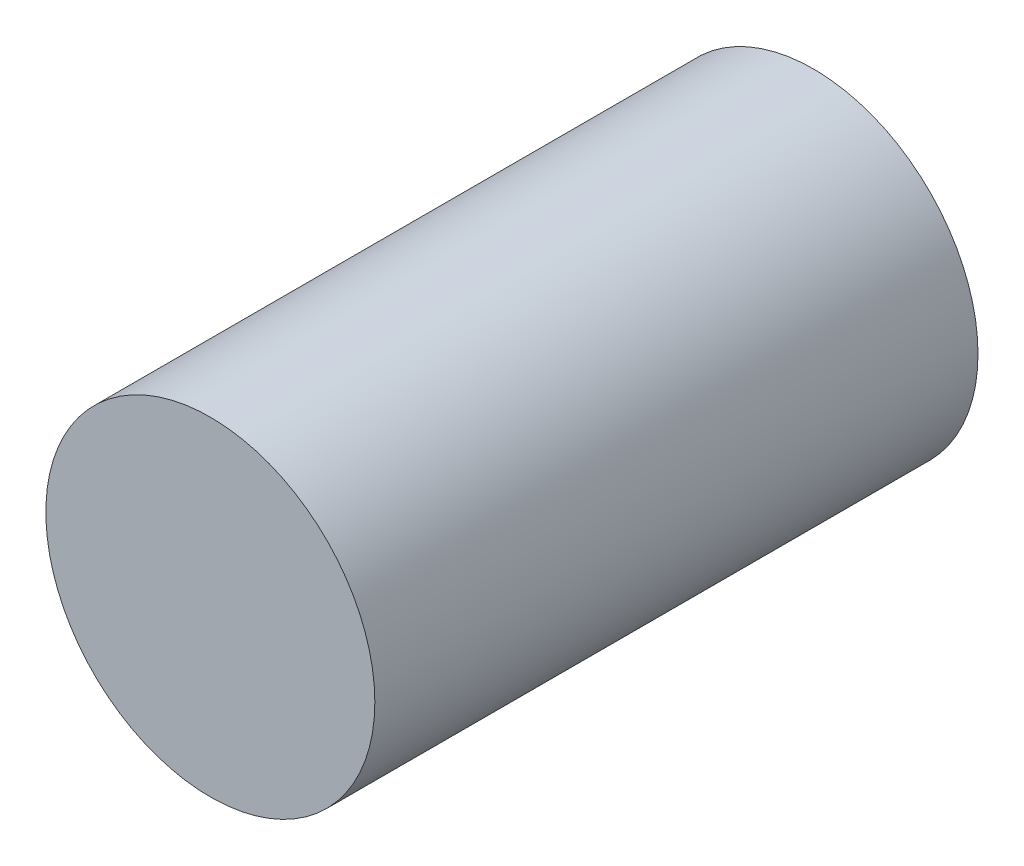
ISO-10303-21;
HEADER;
FILE_DESCRIPTION(('STEP AP214'),'2;1');
FILE_NAME('part.step','',(''),(''),'','','');
FILE_SCHEMA(('AUTOMOTIVE_DESIGN { 1 0 10303 214 1 1 1 1 }'));
ENDSEC;
DATA;
#1=APPLICATION_CONTEXT('core data for automotive mechanical design processes');
#2=APPLICATION_PROTOCOL_DEFINITION('international standard','automotive_design',2000,#1);
#3=PRODUCT_CONTEXT('',#1,'mechanical');
#4=PRODUCT('Part','Part','',(#3));
#5=PRODUCT_RELATED_PRODUCT_CATEGORY('part','',(#4));
#6=PRODUCT_DEFINITION_FORMATION('','',#4);
#7=PRODUCT_DEFINITION_CONTEXT('part definition',#1,'design');
#8=PRODUCT_DEFINITION('design','',#6,#7);
#9=PRODUCT_DEFINITION_SHAPE('','',#8);
#10=(LENGTH_UNIT() NAMED_UNIT(*) SI_UNIT(.MILLI.,.METRE.));
#11=(NAMED_UNIT(*) PLANE_ANGLE_UNIT() SI_UNIT($,.RADIAN.));
#12=(NAMED_UNIT(*) SI_UNIT($,.STERADIAN.) SOLID_ANGLE_UNIT());
#13=UNCERTAINTY_MEASURE_WITH_UNIT(LENGTH_MEASURE(1.E-05),#10,'distance_accuracy_value','');
#14=(GEOMETRIC_REPRESENTATION_CONTEXT(3) GLOBAL_UNCERTAINTY_ASSIGNED_CONTEXT((#13)) GLOBAL_UNIT_ASSIGNED_CONTEXT((#10,
#11,#12)) REPRESENTATION_CONTEXT('',''));
#15=CARTESIAN_POINT('',(0.,0.,0.));
#16=DIRECTION('',(0.,0.,1.));
#17=DIRECTION('',(1.,0.,0.));
#18=AXIS2_PLACEMENT_3D('',#15,#16,#17);
#19=CARTESIAN_POINT('',(0.,0.,55.));
#20=DIRECTION('',(0.,0.,-1.));
#21=DIRECTION('',(-1.,0.,0.));
#22=AXIS2_PLACEMENT_3D('',#19,#20,#21);
#23=CYLINDRICAL_SURFACE('',#22,15.);
#24=CARTESIAN_POINT('',(0.,0.,55.));
#25=DIRECTION('',(0.,0.,1.));
#26=DIRECTION('',(1.,0.,0.));
#27=AXIS2_PLACEMENT_3D('',#24,#25,#26);
#28=CIRCLE('',#27,15.);
#29=CARTESIAN_POINT('',(15.,0.,55.));
#30=VERTEX_POINT('',#29);
#31=EDGE_CURVE('E10',#30,#30,#28,.T.);
#32=ORIENTED_EDGE('',*,*,#31,.F.);
#33=EDGE_LOOP('',(#32));
#34=FACE_BOUND('',#33,.T.);
#35=CARTESIAN_POINT('',(0.,0.,0.));
#36=DIRECTION('',(0.,0.,1.));
#37=DIRECTION('',(1.,0.,0.));
#38=AXIS2_PLACEMENT_3D('',#35,#36,#37);
#39=CIRCLE('',#38,15.);
#40=CARTESIAN_POINT('',(15.,0.,0.));
#41=VERTEX_POINT('',#40);
#42=EDGE_CURVE('E33',#41,#41,#39,.T.);
#43=ORIENTED_EDGE('',*,*,#42,.T.);
#44=EDGE_LOOP('',(#43));
#45=FACE_BOUND('',#44,.T.);
#46=ADVANCED_FACE('F30',(#34,#45),#23,.T.);
#47=CARTESIAN_POINT('',(0.,0.,55.));
#48=DIRECTION('',(0.,0.,1.));
#49=DIRECTION('',(1.,0.,0.));
#50=AXIS2_PLACEMENT_3D('',#47,#48,#49);
#51=PLANE('',#50);
#52=ORIENTED_EDGE('',*,*,#31,.T.);
#53=EDGE_LOOP('',(#52));
#54=FACE_BOUND('',#53,.T.);
#55=ADVANCED_FACE('F45',(#54),#51,.T.);
#56=CARTESIAN_POINT('',(0.,0.,0.));
#57=DIRECTION('',(0.,0.,1.));
#58=DIRECTION('',(1.,0.,0.));
#59=AXIS2_PLACEMENT_3D('',#56,#57,#58);
#60=PLANE('',#59);
#61=ORIENTED_EDGE('',*,*,#42,.F.);
#62=EDGE_LOOP('',(#61));
#63=FACE_BOUND('',#62,.T.);
#64=ADVANCED_FACE('F43',(#63),#60,.F.);
#65=CLOSED_SHELL('',(#46,#55,#64));
#66=MANIFOLD_SOLID_BREP('B2',#65);
#67=ADVANCED_BREP_SHAPE_REPRESENTATION('',(#18,#66),#14);
#68=SHAPE_DEFINITION_REPRESENTATION(#9,#67);
ENDSEC;
END-ISO-10303-21;
